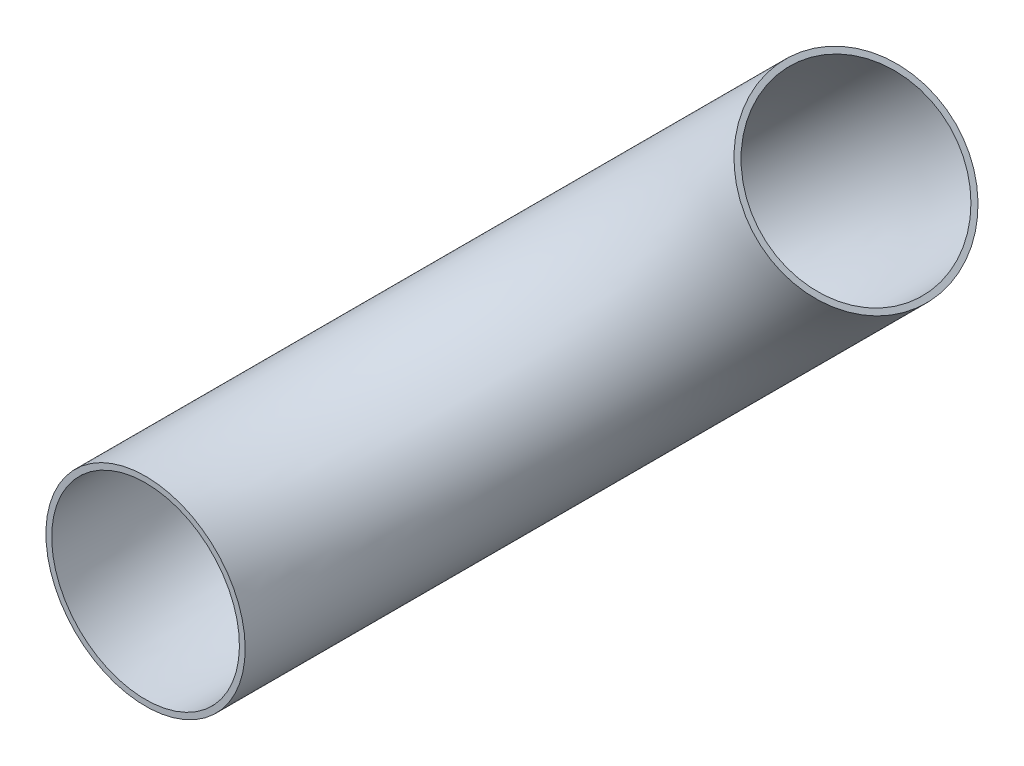
ISO-10303-21;
HEADER;
FILE_DESCRIPTION(('STEP AP214'),'2;1');
FILE_NAME('part.step','',(''),(''),'','','');
FILE_SCHEMA(('AUTOMOTIVE_DESIGN { 1 0 10303 214 1 1 1 1 }'));
ENDSEC;
DATA;
#1=APPLICATION_CONTEXT('core data for automotive mechanical design processes');
#2=APPLICATION_PROTOCOL_DEFINITION('international standard','automotive_design',2000,#1);
#3=PRODUCT_CONTEXT('',#1,'mechanical');
#4=PRODUCT('Part','Part','',(#3));
#5=PRODUCT_RELATED_PRODUCT_CATEGORY('part','',(#4));
#6=PRODUCT_DEFINITION_FORMATION('','',#4);
#7=PRODUCT_DEFINITION_CONTEXT('part definition',#1,'design');
#8=PRODUCT_DEFINITION('design','',#6,#7);
#9=PRODUCT_DEFINITION_SHAPE('','',#8);
#10=(LENGTH_UNIT() NAMED_UNIT(*) SI_UNIT(.MILLI.,.METRE.));
#11=(NAMED_UNIT(*) PLANE_ANGLE_UNIT() SI_UNIT($,.RADIAN.));
#12=(NAMED_UNIT(*) SI_UNIT($,.STERADIAN.) SOLID_ANGLE_UNIT());
#13=UNCERTAINTY_MEASURE_WITH_UNIT(LENGTH_MEASURE(1.E-05),#10,'distance_accuracy_value','');
#14=(GEOMETRIC_REPRESENTATION_CONTEXT(3) GLOBAL_UNCERTAINTY_ASSIGNED_CONTEXT((#13)) GLOBAL_UNIT_ASSIGNED_CONTEXT((#10,
#11,#12)) REPRESENTATION_CONTEXT('',''));
#15=CARTESIAN_POINT('',(0.,0.,0.));
#16=DIRECTION('',(0.,0.,1.));
#17=DIRECTION('',(1.,0.,0.));
#18=AXIS2_PLACEMENT_3D('',#15,#16,#17);
#19=CARTESIAN_POINT('',(323.28922035849,323.28922035849,0.));
#20=DIRECTION('',(-0.707106781186548,0.707106781186547,0.));
#21=DIRECTION('',(-0.707106781186547,-0.707106781186548,0.));
#22=AXIS2_PLACEMENT_3D('',#19,#20,#21);
#23=TOROIDAL_SURFACE('',#22,457.2,103.124);
#24=CARTESIAN_POINT('',(323.28922035849,323.28922035849,-457.2));
#25=DIRECTION('',(-0.707106781186547,-0.707106781186548,0.));
#26=DIRECTION('',(0.5,-0.5,0.707106781186547));
#27=AXIS2_PLACEMENT_3D('',#24,#25,#26);
#28=CIRCLE('',#27,103.124);
#29=CARTESIAN_POINT('',(323.28922035849,323.28922035849,-560.324));
#30=VERTEX_POINT('',#29);
#31=EDGE_CURVE('E36',#30,#30,#28,.T.);
#32=CARTESIAN_POINT('',(0.,0.,0.));
#33=DIRECTION('',(0.,0.,1.));
#34=DIRECTION('',(1.,0.,0.));
#35=AXIS2_PLACEMENT_3D('',#32,#33,#34);
#36=CIRCLE('',#35,103.124);
#37=CARTESIAN_POINT('',(-72.9196797030816,-72.9196797030816,0.));
#38=VERTEX_POINT('',#37);
#39=EDGE_CURVE('E44',#38,#38,#36,.T.);
#40=CARTESIAN_POINT('',(323.28922035849,323.28922035849,0.));
#41=DIRECTION('',(-0.707106781186548,0.707106781186547,0.));
#42=DIRECTION('',(-0.707106781186547,-0.707106781186548,0.));
#43=AXIS2_PLACEMENT_3D('',#40,#41,#42);
#44=CIRCLE('',#43,560.324);
#45=EDGE_CURVE('',#30,#38,#44,.T.);
#46=ORIENTED_EDGE('',*,*,#31,.F.);
#47=ORIENTED_EDGE('',*,*,#39,.T.);
#48=ORIENTED_EDGE('',*,*,#45,.T.);
#49=ORIENTED_EDGE('',*,*,#45,.F.);
#50=EDGE_LOOP('',(#46,#48,#47,#49));
#51=FACE_BOUND('',#50,.T.);
#52=ADVANCED_FACE('F29',(#51),#23,.F.);
#53=CARTESIAN_POINT('',(323.28922035849,323.28922035849,0.));
#54=DIRECTION('',(-0.707106781186548,0.707106781186547,0.));
#55=DIRECTION('',(-0.707106781186547,-0.707106781186548,0.));
#56=AXIS2_PLACEMENT_3D('',#53,#54,#55);
#57=TOROIDAL_SURFACE('',#56,457.2,109.474);
#58=CARTESIAN_POINT('',(323.28922035849,323.28922035849,-457.2));
#59=DIRECTION('',(-0.707106781186547,-0.707106781186548,0.));
#60=DIRECTION('',(0.5,-0.5,0.707106781186547));
#61=AXIS2_PLACEMENT_3D('',#58,#59,#60);
#62=CIRCLE('',#61,109.474);
#63=CARTESIAN_POINT('',(323.28922035849,323.28922035849,-566.674));
#64=VERTEX_POINT('',#63);
#65=EDGE_CURVE('E10',#64,#64,#62,.T.);
#66=CARTESIAN_POINT('',(0.,0.,0.));
#67=DIRECTION('',(0.,0.,1.));
#68=DIRECTION('',(1.,0.,0.));
#69=AXIS2_PLACEMENT_3D('',#66,#67,#68);
#70=CIRCLE('',#69,109.474);
#71=CARTESIAN_POINT('',(-77.4098077636161,-77.4098077636161,0.));
#72=VERTEX_POINT('',#71);
#73=EDGE_CURVE('E40',#72,#72,#70,.T.);
#74=CARTESIAN_POINT('',(323.28922035849,323.28922035849,0.));
#75=DIRECTION('',(-0.707106781186548,0.707106781186547,0.));
#76=DIRECTION('',(-0.707106781186547,-0.707106781186548,0.));
#77=AXIS2_PLACEMENT_3D('',#74,#75,#76);
#78=CIRCLE('',#77,566.674);
#79=EDGE_CURVE('',#64,#72,#78,.T.);
#80=ORIENTED_EDGE('',*,*,#65,.T.);
#81=ORIENTED_EDGE('',*,*,#73,.F.);
#82=ORIENTED_EDGE('',*,*,#79,.T.);
#83=ORIENTED_EDGE('',*,*,#79,.F.);
#84=EDGE_LOOP('',(#80,#82,#81,#83));
#85=FACE_BOUND('',#84,.T.);
#86=ADVANCED_FACE('F31',(#85),#57,.T.);
#87=CARTESIAN_POINT('',(323.28922035849,323.28922035849,-457.2));
#88=DIRECTION('',(-0.707106781186547,-0.707106781186548,0.));
#89=DIRECTION('',(0.5,-0.5,0.707106781186547));
#90=AXIS2_PLACEMENT_3D('',#87,#88,#89);
#91=PLANE('',#90);
#92=ORIENTED_EDGE('',*,*,#31,.T.);
#93=EDGE_LOOP('',(#92));
#94=FACE_BOUND('',#93,.T.);
#95=ORIENTED_EDGE('',*,*,#65,.F.);
#96=EDGE_LOOP('',(#95));
#97=FACE_BOUND('',#96,.T.);
#98=ADVANCED_FACE('F54',(#94,#97),#91,.F.);
#99=CARTESIAN_POINT('',(0.,0.,0.));
#100=DIRECTION('',(0.,0.,1.));
#101=DIRECTION('',(1.,0.,0.));
#102=AXIS2_PLACEMENT_3D('',#99,#100,#101);
#103=PLANE('',#102);
#104=ORIENTED_EDGE('',*,*,#39,.F.);
#105=EDGE_LOOP('',(#104));
#106=FACE_BOUND('',#105,.T.);
#107=ORIENTED_EDGE('',*,*,#73,.T.);
#108=EDGE_LOOP('',(#107));
#109=FACE_BOUND('',#108,.T.);
#110=ADVANCED_FACE('F51',(#106,#109),#103,.T.);
#111=CLOSED_SHELL('',(#52,#86,#98,#110));
#112=MANIFOLD_SOLID_BREP('B2',#111);
#113=ADVANCED_BREP_SHAPE_REPRESENTATION('',(#18,#112),#14);
#114=SHAPE_DEFINITION_REPRESENTATION(#9,#113);
ENDSEC;
END-ISO-10303-21;
